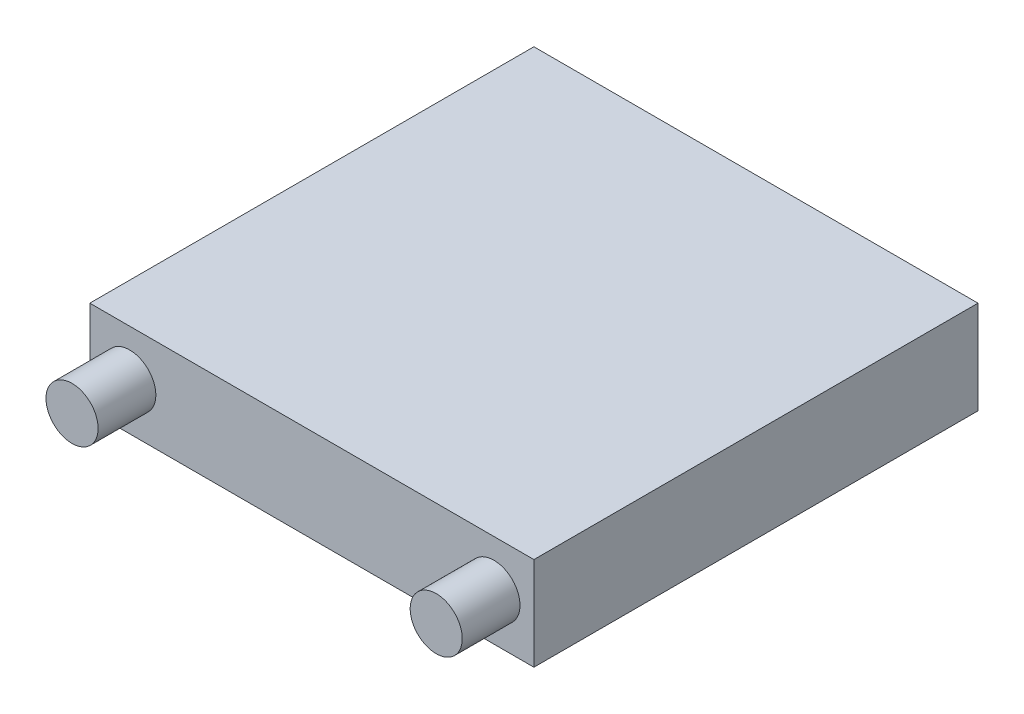
ISO-10303-21;
HEADER;
FILE_DESCRIPTION(('STEP AP214'),'2;1');
FILE_NAME('part.step','',(''),(''),'','','');
FILE_SCHEMA(('AUTOMOTIVE_DESIGN { 1 0 10303 214 1 1 1 1 }'));
ENDSEC;
DATA;
#1=APPLICATION_CONTEXT('core data for automotive mechanical design processes');
#2=APPLICATION_PROTOCOL_DEFINITION('international standard','automotive_design',2000,#1);
#3=PRODUCT_CONTEXT('',#1,'mechanical');
#4=PRODUCT('Part','Part','',(#3));
#5=PRODUCT_RELATED_PRODUCT_CATEGORY('part','',(#4));
#6=PRODUCT_DEFINITION_FORMATION('','',#4);
#7=PRODUCT_DEFINITION_CONTEXT('part definition',#1,'design');
#8=PRODUCT_DEFINITION('design','',#6,#7);
#9=PRODUCT_DEFINITION_SHAPE('','',#8);
#10=(LENGTH_UNIT() NAMED_UNIT(*) SI_UNIT(.MILLI.,.METRE.));
#11=(NAMED_UNIT(*) PLANE_ANGLE_UNIT() SI_UNIT($,.RADIAN.));
#12=(NAMED_UNIT(*) SI_UNIT($,.STERADIAN.) SOLID_ANGLE_UNIT());
#13=UNCERTAINTY_MEASURE_WITH_UNIT(LENGTH_MEASURE(1.E-05),#10,'distance_accuracy_value','');
#14=(GEOMETRIC_REPRESENTATION_CONTEXT(3) GLOBAL_UNCERTAINTY_ASSIGNED_CONTEXT((#13)) GLOBAL_UNIT_ASSIGNED_CONTEXT((#10,
#11,#12)) REPRESENTATION_CONTEXT('',''));
#15=CARTESIAN_POINT('',(0.,0.,0.));
#16=DIRECTION('',(0.,0.,1.));
#17=DIRECTION('',(1.,0.,0.));
#18=AXIS2_PLACEMENT_3D('',#15,#16,#17);
#19=CARTESIAN_POINT('',(10.,4.2,-10.));
#20=DIRECTION('',(-1.,0.,0.));
#21=DIRECTION('',(0.,0.,1.));
#22=AXIS2_PLACEMENT_3D('',#19,#20,#21);
#23=PLANE('',#22);
#24=DIRECTION('',(0.,0.,-1.));
#25=VECTOR('',#24,1.);
#26=CARTESIAN_POINT('',(10.,0.,-10.));
#27=LINE('',#26,#25);
#28=CARTESIAN_POINT('',(10.,0.,10.));
#29=VERTEX_POINT('',#28);
#30=CARTESIAN_POINT('',(10.,0.,-10.));
#31=VERTEX_POINT('',#30);
#32=EDGE_CURVE('E111',#29,#31,#27,.T.);
#33=ORIENTED_EDGE('',*,*,#32,.T.);
#34=DIRECTION('',(0.,-1.,0.));
#35=VECTOR('',#34,1.);
#36=CARTESIAN_POINT('',(10.,4.2,-10.));
#37=LINE('',#36,#35);
#38=CARTESIAN_POINT('',(10.,4.2,-10.));
#39=VERTEX_POINT('',#38);
#40=EDGE_CURVE('E100',#39,#31,#37,.T.);
#41=ORIENTED_EDGE('',*,*,#40,.F.);
#42=DIRECTION('',(0.,0.,-1.));
#43=VECTOR('',#42,1.);
#44=CARTESIAN_POINT('',(10.,4.2,-10.));
#45=LINE('',#44,#43);
#46=CARTESIAN_POINT('',(10.,4.2,10.));
#47=VERTEX_POINT('',#46);
#48=EDGE_CURVE('E92',#47,#39,#45,.T.);
#49=ORIENTED_EDGE('',*,*,#48,.F.);
#50=DIRECTION('',(0.,-1.,0.));
#51=VECTOR('',#50,1.);
#52=CARTESIAN_POINT('',(10.,4.2,10.));
#53=LINE('',#52,#51);
#54=EDGE_CURVE('E107',#47,#29,#53,.T.);
#55=ORIENTED_EDGE('',*,*,#54,.T.);
#56=EDGE_LOOP('',(#33,#41,#49,#55));
#57=FACE_BOUND('',#56,.T.);
#58=ADVANCED_FACE('F39',(#57),#23,.F.);
#59=CARTESIAN_POINT('',(-10.,4.2,-10.));
#60=DIRECTION('',(0.,0.,1.));
#61=DIRECTION('',(1.,0.,0.));
#62=AXIS2_PLACEMENT_3D('',#59,#60,#61);
#63=PLANE('',#62);
#64=DIRECTION('',(-1.,0.,0.));
#65=VECTOR('',#64,1.);
#66=CARTESIAN_POINT('',(-10.,0.,-10.));
#67=LINE('',#66,#65);
#68=CARTESIAN_POINT('',(-10.,0.,-10.));
#69=VERTEX_POINT('',#68);
#70=EDGE_CURVE('E98',#31,#69,#67,.T.);
#71=ORIENTED_EDGE('',*,*,#70,.T.);
#72=DIRECTION('',(0.,-1.,0.));
#73=VECTOR('',#72,1.);
#74=CARTESIAN_POINT('',(-10.,4.2,-10.));
#75=LINE('',#74,#73);
#76=CARTESIAN_POINT('',(-10.,4.2,-10.));
#77=VERTEX_POINT('',#76);
#78=EDGE_CURVE('E96',#77,#69,#75,.T.);
#79=ORIENTED_EDGE('',*,*,#78,.F.);
#80=DIRECTION('',(-1.,0.,0.));
#81=VECTOR('',#80,1.);
#82=CARTESIAN_POINT('',(-10.,4.2,-10.));
#83=LINE('',#82,#81);
#84=EDGE_CURVE('E87',#39,#77,#83,.T.);
#85=ORIENTED_EDGE('',*,*,#84,.F.);
#86=ORIENTED_EDGE('',*,*,#40,.T.);
#87=EDGE_LOOP('',(#71,#79,#85,#86));
#88=FACE_BOUND('',#87,.T.);
#89=ADVANCED_FACE('F97',(#88),#63,.F.);
#90=CARTESIAN_POINT('',(-10.,4.2,-10.));
#91=DIRECTION('',(1.,0.,0.));
#92=DIRECTION('',(0.,0.,-1.));
#93=AXIS2_PLACEMENT_3D('',#90,#91,#92);
#94=PLANE('',#93);
#95=DIRECTION('',(0.,0.,1.));
#96=VECTOR('',#95,1.);
#97=CARTESIAN_POINT('',(-10.,0.,-10.));
#98=LINE('',#97,#96);
#99=CARTESIAN_POINT('',(-10.,0.,10.));
#100=VERTEX_POINT('',#99);
#101=EDGE_CURVE('E73',#69,#100,#98,.T.);
#102=ORIENTED_EDGE('',*,*,#101,.T.);
#103=DIRECTION('',(0.,-1.,0.));
#104=VECTOR('',#103,1.);
#105=CARTESIAN_POINT('',(-10.,4.2,10.));
#106=LINE('',#105,#104);
#107=CARTESIAN_POINT('',(-10.,4.2,10.));
#108=VERTEX_POINT('',#107);
#109=EDGE_CURVE('E101',#108,#100,#106,.T.);
#110=ORIENTED_EDGE('',*,*,#109,.F.);
#111=DIRECTION('',(0.,0.,1.));
#112=VECTOR('',#111,1.);
#113=CARTESIAN_POINT('',(-10.,4.2,-10.));
#114=LINE('',#113,#112);
#115=EDGE_CURVE('E90',#77,#108,#114,.T.);
#116=ORIENTED_EDGE('',*,*,#115,.F.);
#117=ORIENTED_EDGE('',*,*,#78,.T.);
#118=EDGE_LOOP('',(#102,#110,#116,#117));
#119=FACE_BOUND('',#118,.T.);
#120=ADVANCED_FACE('F103',(#119),#94,.F.);
#121=CARTESIAN_POINT('',(-10.,4.2,10.));
#122=DIRECTION('',(0.,0.,-1.));
#123=DIRECTION('',(-1.,0.,0.));
#124=AXIS2_PLACEMENT_3D('',#121,#122,#123);
#125=PLANE('',#124);
#126=CARTESIAN_POINT('',(8.2,2.1,10.));
#127=DIRECTION('',(0.,0.,-1.));
#128=DIRECTION('',(-1.,0.,0.));
#129=AXIS2_PLACEMENT_3D('',#126,#127,#128);
#130=CIRCLE('',#129,1.17313176410376);
#131=CARTESIAN_POINT('',(7.02686823589624,2.1,10.));
#132=VERTEX_POINT('',#131);
#133=EDGE_CURVE('E11',#132,#132,#130,.F.);
#134=ORIENTED_EDGE('',*,*,#133,.F.);
#135=EDGE_LOOP('',(#134));
#136=FACE_BOUND('',#135,.T.);
#137=CARTESIAN_POINT('',(-8.2,2.1,10.));
#138=DIRECTION('',(0.,0.,-1.));
#139=DIRECTION('',(-1.,0.,0.));
#140=AXIS2_PLACEMENT_3D('',#137,#138,#139);
#141=CIRCLE('',#140,1.17313176410376);
#142=CARTESIAN_POINT('',(-9.37313176410376,2.1,10.));
#143=VERTEX_POINT('',#142);
#144=EDGE_CURVE('E48',#143,#143,#141,.F.);
#145=ORIENTED_EDGE('',*,*,#144,.F.);
#146=EDGE_LOOP('',(#145));
#147=FACE_BOUND('',#146,.T.);
#148=DIRECTION('',(1.,0.,0.));
#149=VECTOR('',#148,1.);
#150=CARTESIAN_POINT('',(-10.,0.,10.));
#151=LINE('',#150,#149);
#152=EDGE_CURVE('E79',#100,#29,#151,.T.);
#153=ORIENTED_EDGE('',*,*,#152,.T.);
#154=ORIENTED_EDGE('',*,*,#54,.F.);
#155=DIRECTION('',(1.,0.,0.));
#156=VECTOR('',#155,1.);
#157=CARTESIAN_POINT('',(-10.,4.2,10.));
#158=LINE('',#157,#156);
#159=EDGE_CURVE('E56',#108,#47,#158,.T.);
#160=ORIENTED_EDGE('',*,*,#159,.F.);
#161=ORIENTED_EDGE('',*,*,#109,.T.);
#162=EDGE_LOOP('',(#153,#154,#160,#161));
#163=FACE_BOUND('',#162,.T.);
#164=ADVANCED_FACE('F133',(#136,#147,#163),#125,.F.);
#165=CARTESIAN_POINT('',(0.,4.2,0.));
#166=DIRECTION('',(0.,1.,0.));
#167=DIRECTION('',(0.,0.,1.));
#168=AXIS2_PLACEMENT_3D('',#165,#166,#167);
#169=PLANE('',#168);
#170=ORIENTED_EDGE('',*,*,#48,.T.);
#171=ORIENTED_EDGE('',*,*,#84,.T.);
#172=ORIENTED_EDGE('',*,*,#115,.T.);
#173=ORIENTED_EDGE('',*,*,#159,.T.);
#174=EDGE_LOOP('',(#170,#171,#172,#173));
#175=FACE_BOUND('',#174,.T.);
#176=ADVANCED_FACE('F88',(#175),#169,.T.);
#177=CARTESIAN_POINT('',(0.,0.,0.));
#178=DIRECTION('',(0.,1.,0.));
#179=DIRECTION('',(0.,0.,1.));
#180=AXIS2_PLACEMENT_3D('',#177,#178,#179);
#181=PLANE('',#180);
#182=ORIENTED_EDGE('',*,*,#32,.F.);
#183=ORIENTED_EDGE('',*,*,#152,.F.);
#184=ORIENTED_EDGE('',*,*,#101,.F.);
#185=ORIENTED_EDGE('',*,*,#70,.F.);
#186=EDGE_LOOP('',(#182,#183,#184,#185));
#187=FACE_BOUND('',#186,.T.);
#188=ADVANCED_FACE('F141',(#187),#181,.F.);
#189=CARTESIAN_POINT('',(-8.2,2.1,12.6));
#190=DIRECTION('',(0.,0.,-1.));
#191=DIRECTION('',(-1.,0.,0.));
#192=AXIS2_PLACEMENT_3D('',#189,#190,#191);
#193=CYLINDRICAL_SURFACE('',#192,1.17313176410376);
#194=CARTESIAN_POINT('',(-8.2,2.1,12.6));
#195=DIRECTION('',(0.,0.,1.));
#196=DIRECTION('',(1.,0.,0.));
#197=AXIS2_PLACEMENT_3D('',#194,#195,#196);
#198=CIRCLE('',#197,1.17313176410376);
#199=CARTESIAN_POINT('',(-7.02686823589624,2.1,12.6));
#200=VERTEX_POINT('',#199);
#201=EDGE_CURVE('E115',#200,#200,#198,.T.);
#202=ORIENTED_EDGE('',*,*,#201,.F.);
#203=EDGE_LOOP('',(#202));
#204=FACE_BOUND('',#203,.T.);
#205=ORIENTED_EDGE('',*,*,#144,.T.);
#206=EDGE_LOOP('',(#205));
#207=FACE_BOUND('',#206,.T.);
#208=ADVANCED_FACE('F131',(#204,#207),#193,.T.);
#209=CARTESIAN_POINT('',(-8.2,2.1,12.6));
#210=DIRECTION('',(0.,0.,1.));
#211=DIRECTION('',(1.,0.,0.));
#212=AXIS2_PLACEMENT_3D('',#209,#210,#211);
#213=PLANE('',#212);
#214=ORIENTED_EDGE('',*,*,#201,.T.);
#215=EDGE_LOOP('',(#214));
#216=FACE_BOUND('',#215,.T.);
#217=ADVANCED_FACE('F157',(#216),#213,.T.);
#218=CARTESIAN_POINT('',(8.2,2.1,12.6));
#219=DIRECTION('',(0.,0.,-1.));
#220=DIRECTION('',(-1.,0.,0.));
#221=AXIS2_PLACEMENT_3D('',#218,#219,#220);
#222=CYLINDRICAL_SURFACE('',#221,1.17313176410376);
#223=CARTESIAN_POINT('',(8.2,2.1,12.6));
#224=DIRECTION('',(0.,0.,1.));
#225=DIRECTION('',(-1.,0.,0.));
#226=AXIS2_PLACEMENT_3D('',#223,#224,#225);
#227=CIRCLE('',#226,1.17313176410376);
#228=CARTESIAN_POINT('',(7.02686823589624,2.1,12.6));
#229=VERTEX_POINT('',#228);
#230=EDGE_CURVE('E175',#229,#229,#227,.T.);
#231=ORIENTED_EDGE('',*,*,#230,.F.);
#232=EDGE_LOOP('',(#231));
#233=FACE_BOUND('',#232,.T.);
#234=ORIENTED_EDGE('',*,*,#133,.T.);
#235=EDGE_LOOP('',(#234));
#236=FACE_BOUND('',#235,.T.);
#237=ADVANCED_FACE('F163',(#233,#236),#222,.T.);
#238=CARTESIAN_POINT('',(8.2,2.1,12.6));
#239=DIRECTION('',(0.,0.,-1.));
#240=DIRECTION('',(-1.,0.,0.));
#241=AXIS2_PLACEMENT_3D('',#238,#239,#240);
#242=PLANE('',#241);
#243=ORIENTED_EDGE('',*,*,#230,.T.);
#244=EDGE_LOOP('',(#243));
#245=FACE_BOUND('',#244,.T.);
#246=ADVANCED_FACE('F167',(#245),#242,.F.);
#247=CLOSED_SHELL('',(#58,#89,#120,#164,#176,#188,#208,#217,#237,#246));
#248=MANIFOLD_SOLID_BREP('B2',#247);
#249=ADVANCED_BREP_SHAPE_REPRESENTATION('',(#18,#248),#14);
#250=SHAPE_DEFINITION_REPRESENTATION(#9,#249);
ENDSEC;
END-ISO-10303-21;
